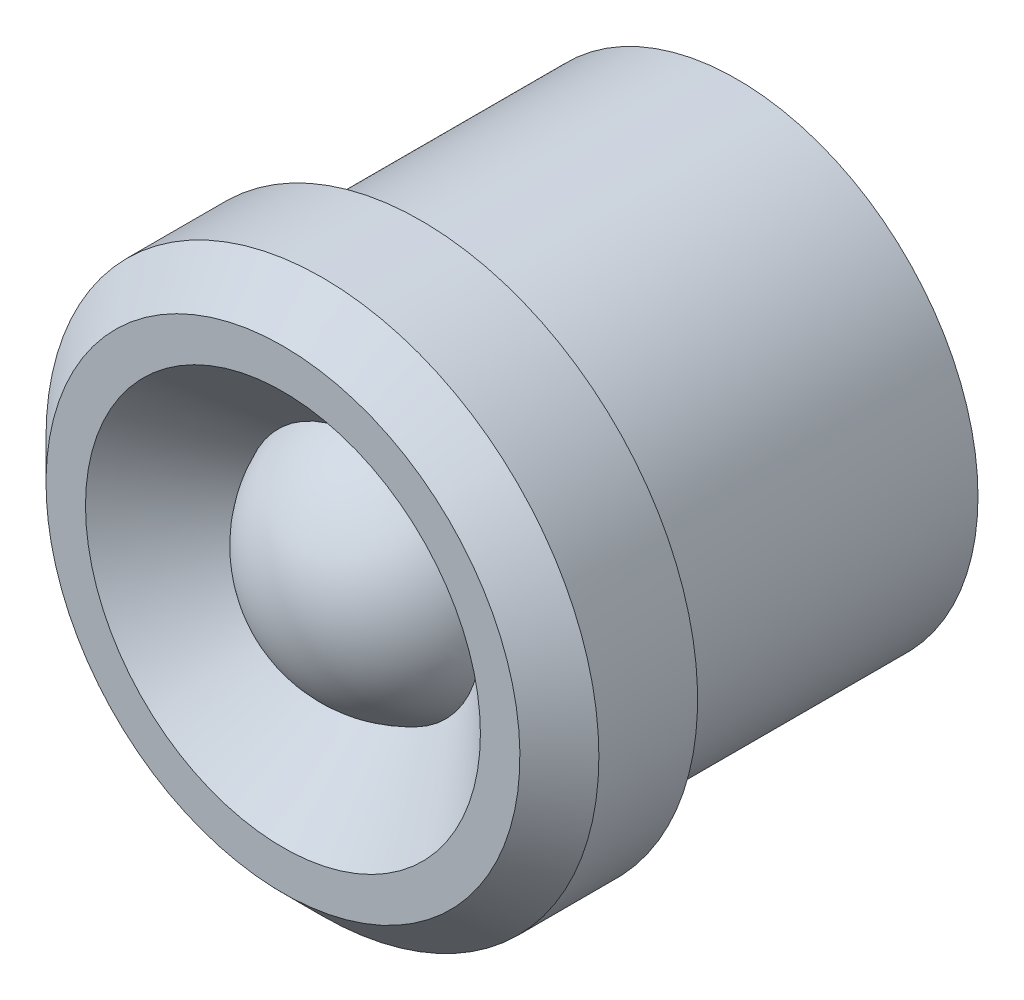
ISO-10303-21;
HEADER;
FILE_DESCRIPTION(('STEP AP214'),'2;1');
FILE_NAME('part.step','',(''),(''),'','','');
FILE_SCHEMA(('AUTOMOTIVE_DESIGN { 1 0 10303 214 1 1 1 1 }'));
ENDSEC;
DATA;
#1=APPLICATION_CONTEXT('core data for automotive mechanical design processes');
#2=APPLICATION_PROTOCOL_DEFINITION('international standard','automotive_design',2000,#1);
#3=PRODUCT_CONTEXT('',#1,'mechanical');
#4=PRODUCT('Part','Part','',(#3));
#5=PRODUCT_RELATED_PRODUCT_CATEGORY('part','',(#4));
#6=PRODUCT_DEFINITION_FORMATION('','',#4);
#7=PRODUCT_DEFINITION_CONTEXT('part definition',#1,'design');
#8=PRODUCT_DEFINITION('design','',#6,#7);
#9=PRODUCT_DEFINITION_SHAPE('','',#8);
#10=(LENGTH_UNIT() NAMED_UNIT(*) SI_UNIT(.MILLI.,.METRE.));
#11=(NAMED_UNIT(*) PLANE_ANGLE_UNIT() SI_UNIT($,.RADIAN.));
#12=(NAMED_UNIT(*) SI_UNIT($,.STERADIAN.) SOLID_ANGLE_UNIT());
#13=UNCERTAINTY_MEASURE_WITH_UNIT(LENGTH_MEASURE(1.E-05),#10,'distance_accuracy_value','');
#14=(GEOMETRIC_REPRESENTATION_CONTEXT(3) GLOBAL_UNCERTAINTY_ASSIGNED_CONTEXT((#13)) GLOBAL_UNIT_ASSIGNED_CONTEXT((#10,
#11,#12)) REPRESENTATION_CONTEXT('',''));
#15=CARTESIAN_POINT('',(0.,0.,0.));
#16=DIRECTION('',(0.,0.,1.));
#17=DIRECTION('',(1.,0.,0.));
#18=AXIS2_PLACEMENT_3D('',#15,#16,#17);
#19=CARTESIAN_POINT('',(0.,0.,0.));
#20=DIRECTION('',(0.,0.,1.));
#21=DIRECTION('',(1.,0.,0.));
#22=AXIS2_PLACEMENT_3D('',#19,#20,#21);
#23=PLANE('',#22);
#24=CARTESIAN_POINT('',(0.,0.,0.));
#25=DIRECTION('',(0.,0.,-1.));
#26=DIRECTION('',(-1.,0.,0.));
#27=AXIS2_PLACEMENT_3D('',#24,#25,#26);
#28=CIRCLE('',#27,3.);
#29=CARTESIAN_POINT('',(-3.,0.,0.));
#30=VERTEX_POINT('',#29);
#31=EDGE_CURVE('E19',#30,#30,#28,.F.);
#32=ORIENTED_EDGE('',*,*,#31,.F.);
#33=EDGE_LOOP('',(#32));
#34=FACE_BOUND('',#33,.T.);
#35=ADVANCED_FACE('F16',(#34),#23,.F.);
#36=CARTESIAN_POINT('',(0.,0.,0.));
#37=DIRECTION('',(0.,0.,-1.));
#38=DIRECTION('',(-1.,0.,0.));
#39=AXIS2_PLACEMENT_3D('',#36,#37,#38);
#40=CYLINDRICAL_SURFACE('',#39,3.);
#41=CARTESIAN_POINT('',(0.,0.,-8.));
#42=DIRECTION('',(0.,0.,-1.));
#43=DIRECTION('',(-1.,0.,0.));
#44=AXIS2_PLACEMENT_3D('',#41,#42,#43);
#45=CIRCLE('',#44,3.);
#46=CARTESIAN_POINT('',(-3.,0.,-8.));
#47=VERTEX_POINT('',#46);
#48=EDGE_CURVE('E56',#47,#47,#45,.F.);
#49=ORIENTED_EDGE('',*,*,#48,.F.);
#50=EDGE_LOOP('',(#49));
#51=FACE_BOUND('',#50,.T.);
#52=ORIENTED_EDGE('',*,*,#31,.T.);
#53=EDGE_LOOP('',(#52));
#54=FACE_BOUND('',#53,.T.);
#55=ADVANCED_FACE('F63',(#51,#54),#40,.F.);
#56=CARTESIAN_POINT('',(0.,0.,-8.));
#57=DIRECTION('',(0.,0.,-1.));
#58=DIRECTION('',(-1.,0.,0.));
#59=AXIS2_PLACEMENT_3D('',#56,#57,#58);
#60=PLANE('',#59);
#61=ORIENTED_EDGE('',*,*,#48,.T.);
#62=EDGE_LOOP('',(#61));
#63=FACE_BOUND('',#62,.T.);
#64=CARTESIAN_POINT('',(0.,0.,-8.));
#65=DIRECTION('',(0.,0.,1.));
#66=DIRECTION('',(1.,0.,0.));
#67=AXIS2_PLACEMENT_3D('',#64,#65,#66);
#68=CIRCLE('',#67,6.1);
#69=CARTESIAN_POINT('',(6.1,0.,-8.));
#70=VERTEX_POINT('',#69);
#71=EDGE_CURVE('E54',#70,#70,#68,.T.);
#72=ORIENTED_EDGE('',*,*,#71,.F.);
#73=EDGE_LOOP('',(#72));
#74=FACE_BOUND('',#73,.T.);
#75=ADVANCED_FACE('F70',(#63,#74),#60,.T.);
#76=CARTESIAN_POINT('',(0.,0.,0.));
#77=DIRECTION('',(0.,0.,1.));
#78=DIRECTION('',(1.,0.,0.));
#79=AXIS2_PLACEMENT_3D('',#76,#77,#78);
#80=CYLINDRICAL_SURFACE('',#79,6.1);
#81=CARTESIAN_POINT('',(0.,0.,0.));
#82=DIRECTION('',(0.,0.,1.));
#83=DIRECTION('',(1.,0.,0.));
#84=AXIS2_PLACEMENT_3D('',#81,#82,#83);
#85=CIRCLE('',#84,6.1);
#86=CARTESIAN_POINT('',(6.1,0.,0.));
#87=VERTEX_POINT('',#86);
#88=EDGE_CURVE('E51',#87,#87,#85,.T.);
#89=ORIENTED_EDGE('',*,*,#88,.F.);
#90=EDGE_LOOP('',(#89));
#91=FACE_BOUND('',#90,.T.);
#92=ORIENTED_EDGE('',*,*,#71,.T.);
#93=EDGE_LOOP('',(#92));
#94=FACE_BOUND('',#93,.T.);
#95=ADVANCED_FACE('F75',(#91,#94),#80,.T.);
#96=CARTESIAN_POINT('',(0.,0.,0.));
#97=DIRECTION('',(0.,0.,1.));
#98=DIRECTION('',(1.,0.,0.));
#99=AXIS2_PLACEMENT_3D('',#96,#97,#98);
#100=PLANE('',#99);
#101=ORIENTED_EDGE('',*,*,#88,.T.);
#102=EDGE_LOOP('',(#101));
#103=FACE_BOUND('',#102,.T.);
#104=CARTESIAN_POINT('',(0.,0.,0.));
#105=DIRECTION('',(0.,0.,-1.));
#106=DIRECTION('',(-1.,0.,0.));
#107=AXIS2_PLACEMENT_3D('',#104,#105,#106);
#108=CIRCLE('',#107,7.);
#109=CARTESIAN_POINT('',(-7.,0.,0.));
#110=VERTEX_POINT('',#109);
#111=EDGE_CURVE('E48',#110,#110,#108,.F.);
#112=ORIENTED_EDGE('',*,*,#111,.F.);
#113=EDGE_LOOP('',(#112));
#114=FACE_BOUND('',#113,.T.);
#115=ADVANCED_FACE('F80',(#103,#114),#100,.F.);
#116=CARTESIAN_POINT('',(0.,0.,0.));
#117=DIRECTION('',(0.,0.,-1.));
#118=DIRECTION('',(-1.,0.,0.));
#119=AXIS2_PLACEMENT_3D('',#116,#117,#118);
#120=CYLINDRICAL_SURFACE('',#119,7.);
#121=ORIENTED_EDGE('',*,*,#111,.T.);
#122=EDGE_LOOP('',(#121));
#123=FACE_BOUND('',#122,.T.);
#124=CARTESIAN_POINT('',(0.,0.,2.49999999999995));
#125=DIRECTION('',(0.,0.,-1.));
#126=DIRECTION('',(-1.,0.,0.));
#127=AXIS2_PLACEMENT_3D('',#124,#125,#126);
#128=CIRCLE('',#127,7.);
#129=CARTESIAN_POINT('',(-7.,0.,2.5));
#130=VERTEX_POINT('',#129);
#131=EDGE_CURVE('E44',#130,#130,#128,.F.);
#132=ORIENTED_EDGE('',*,*,#131,.F.);
#133=EDGE_LOOP('',(#132));
#134=FACE_BOUND('',#133,.T.);
#135=ADVANCED_FACE('F84',(#123,#134),#120,.T.);
#136=CARTESIAN_POINT('',(0.,0.,2.5));
#137=DIRECTION('',(0.,0.,-1.));
#138=DIRECTION('',(0.,1.,0.));
#139=AXIS2_PLACEMENT_3D('',#136,#137,#138);
#140=CONICAL_SURFACE('',#139,7.,0.785398163397448);
#141=ORIENTED_EDGE('',*,*,#131,.T.);
#142=EDGE_LOOP('',(#141));
#143=FACE_BOUND('',#142,.T.);
#144=CARTESIAN_POINT('',(0.,0.,3.50000000000006));
#145=DIRECTION('',(0.,0.,-1.));
#146=DIRECTION('',(0.,1.,0.));
#147=AXIS2_PLACEMENT_3D('',#144,#145,#146);
#148=CIRCLE('',#147,5.99999999999994);
#149=CARTESIAN_POINT('',(0.,5.99999999999994,3.50000000000006));
#150=VERTEX_POINT('',#149);
#151=EDGE_CURVE('E41',#150,#150,#148,.F.);
#152=ORIENTED_EDGE('',*,*,#151,.F.);
#153=EDGE_LOOP('',(#152));
#154=FACE_BOUND('',#153,.T.);
#155=ADVANCED_FACE('F88',(#143,#154),#140,.T.);
#156=CARTESIAN_POINT('',(0.,0.,3.5));
#157=DIRECTION('',(0.,0.,1.));
#158=DIRECTION('',(1.,0.,0.));
#159=AXIS2_PLACEMENT_3D('',#156,#157,#158);
#160=PLANE('',#159);
#161=CARTESIAN_POINT('',(0.,0.,3.49999999999995));
#162=DIRECTION('',(0.,0.,1.));
#163=DIRECTION('',(1.,0.,0.));
#164=AXIS2_PLACEMENT_3D('',#161,#162,#163);
#165=CIRCLE('',#164,4.99999999999995);
#166=CARTESIAN_POINT('',(4.99999999999995,0.,3.49999999999995));
#167=VERTEX_POINT('',#166);
#168=EDGE_CURVE('E23',#167,#167,#165,.T.);
#169=ORIENTED_EDGE('',*,*,#168,.F.);
#170=EDGE_LOOP('',(#169));
#171=FACE_BOUND('',#170,.T.);
#172=ORIENTED_EDGE('',*,*,#151,.T.);
#173=EDGE_LOOP('',(#172));
#174=FACE_BOUND('',#173,.T.);
#175=ADVANCED_FACE('F36',(#171,#174),#160,.T.);
#176=CARTESIAN_POINT('',(0.,0.,1.5));
#177=DIRECTION('',(0.,0.,1.));
#178=DIRECTION('',(1.,0.,0.));
#179=AXIS2_PLACEMENT_3D('',#176,#177,#178);
#180=CONICAL_SURFACE('',#179,3.,0.785398163397448);
#181=CARTESIAN_POINT('',(0.,0.,1.50000000000003));
#182=DIRECTION('',(0.,0.,1.));
#183=DIRECTION('',(1.,0.,0.));
#184=AXIS2_PLACEMENT_3D('',#181,#182,#183);
#185=CIRCLE('',#184,3.00000000000008);
#186=CARTESIAN_POINT('',(3.00000000000008,-1.85043152221923E-13,1.50000000000003));
#187=VERTEX_POINT('',#186);
#188=EDGE_CURVE('E11',#187,#187,#185,.T.);
#189=ORIENTED_EDGE('',*,*,#188,.F.);
#190=EDGE_LOOP('',(#189));
#191=FACE_BOUND('',#190,.T.);
#192=ORIENTED_EDGE('',*,*,#168,.T.);
#193=EDGE_LOOP('',(#192));
#194=FACE_BOUND('',#193,.T.);
#195=ADVANCED_FACE('F30',(#191,#194),#180,.F.);
#196=CARTESIAN_POINT('',(0.,-1.78112244801043E-13,3.50000000000018));
#197=CARTESIAN_POINT('',(6.50000000000007,-1.62604365803161E-13,3.50000000000009));
#198=CARTESIAN_POINT('',(6.49999999999997,-2.08391633417844E-13,-2.99999999999991));
#199=CARTESIAN_POINT('',(0.,-2.23899512415727E-13,-2.99999999999982));
#200=(BOUNDED_CURVE() B_SPLINE_CURVE(3,(#196,#197,#198,#199),.UNSPECIFIED.,.F.,
.F.) B_SPLINE_CURVE_WITH_KNOTS((4,4),(0.,1.),
.UNSPECIFIED.) CURVE() GEOMETRIC_REPRESENTATION_ITEM() RATIONAL_B_SPLINE_CURVE((1.,
0.333333333333333,0.333333333333333,1.)) REPRESENTATION_ITEM(''));
#201=CARTESIAN_POINT('',(0.,0.,0.25));
#202=DIRECTION('',(0.,0.,1.));
#203=AXIS1_PLACEMENT('',#201,#202);
#204=SURFACE_OF_REVOLUTION('',#200,#203);
#205=CARTESIAN_POINT('',(0.,1.78112244531034E-13,3.50000000000018));
#206=VERTEX_POINT('',#205);
#207=VERTEX_LOOP('',#206);
#208=FACE_BOUND('',#207,.T.);
#209=ORIENTED_EDGE('',*,*,#188,.T.);
#210=EDGE_LOOP('',(#209));
#211=FACE_BOUND('',#210,.T.);
#212=ADVANCED_FACE('F27',(#208,#211),#204,.F.);
#213=CLOSED_SHELL('',(#35,#55,#75,#95,#115,#135,#155,#175,#195,#212));
#214=MANIFOLD_SOLID_BREP('B1',#213);
#215=ADVANCED_BREP_SHAPE_REPRESENTATION('',(#18,#214),#14);
#216=SHAPE_DEFINITION_REPRESENTATION(#9,#215);
ENDSEC;
END-ISO-10303-21;
